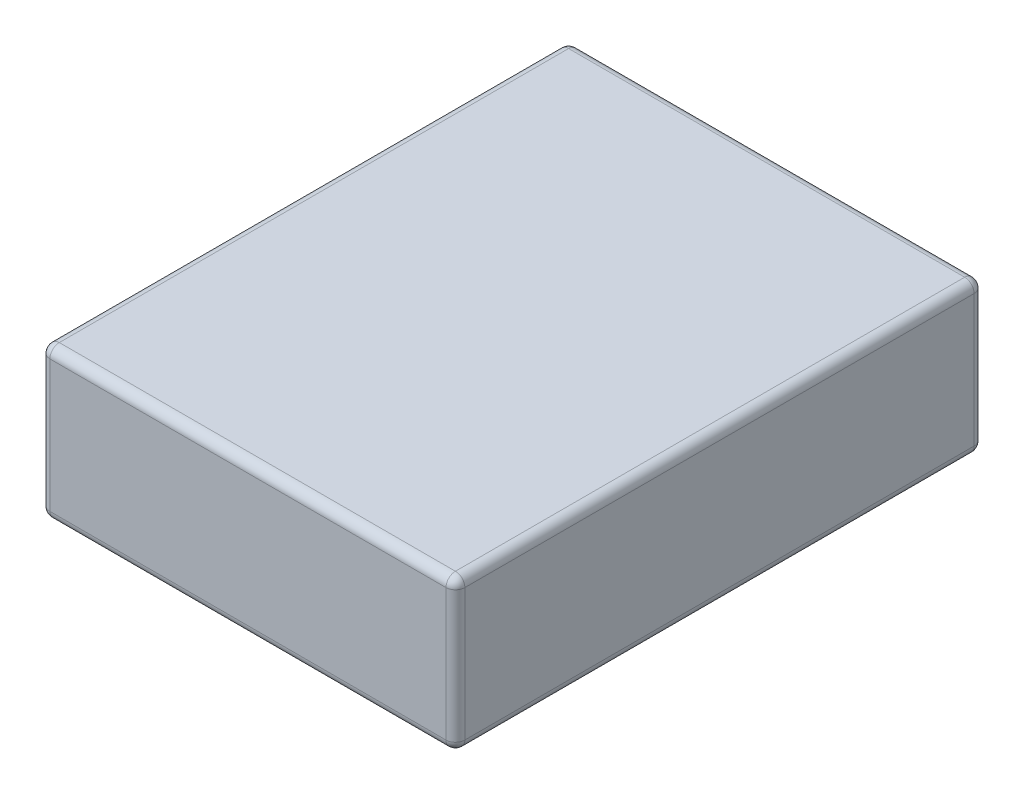
ISO-10303-21;
HEADER;
FILE_DESCRIPTION(('STEP AP214'),'2;1');
FILE_NAME('part.step','',(''),(''),'','','');
FILE_SCHEMA(('AUTOMOTIVE_DESIGN { 1 0 10303 214 1 1 1 1 }'));
ENDSEC;
DATA;
#1=APPLICATION_CONTEXT('core data for automotive mechanical design processes');
#2=APPLICATION_PROTOCOL_DEFINITION('international standard','automotive_design',2000,#1);
#3=PRODUCT_CONTEXT('',#1,'mechanical');
#4=PRODUCT('Part','Part','',(#3));
#5=PRODUCT_RELATED_PRODUCT_CATEGORY('part','',(#4));
#6=PRODUCT_DEFINITION_FORMATION('','',#4);
#7=PRODUCT_DEFINITION_CONTEXT('part definition',#1,'design');
#8=PRODUCT_DEFINITION('design','',#6,#7);
#9=PRODUCT_DEFINITION_SHAPE('','',#8);
#10=(LENGTH_UNIT() NAMED_UNIT(*) SI_UNIT(.MILLI.,.METRE.));
#11=(NAMED_UNIT(*) PLANE_ANGLE_UNIT() SI_UNIT($,.RADIAN.));
#12=(NAMED_UNIT(*) SI_UNIT($,.STERADIAN.) SOLID_ANGLE_UNIT());
#13=UNCERTAINTY_MEASURE_WITH_UNIT(LENGTH_MEASURE(1.E-05),#10,'distance_accuracy_value','');
#14=(GEOMETRIC_REPRESENTATION_CONTEXT(3) GLOBAL_UNCERTAINTY_ASSIGNED_CONTEXT((#13)) GLOBAL_UNIT_ASSIGNED_CONTEXT((#10,
#11,#12)) REPRESENTATION_CONTEXT('',''));
#15=CARTESIAN_POINT('',(0.,0.,0.));
#16=DIRECTION('',(0.,0.,1.));
#17=DIRECTION('',(1.,0.,0.));
#18=AXIS2_PLACEMENT_3D('',#15,#16,#17);
#19=CARTESIAN_POINT('',(-11.,8.,-14.));
#20=DIRECTION('',(1.,0.,0.));
#21=DIRECTION('',(0.,0.,-1.));
#22=AXIS2_PLACEMENT_3D('',#19,#20,#21);
#23=PLANE('',#22);
#24=DIRECTION('',(0.,-1.,0.));
#25=VECTOR('',#24,1.);
#26=CARTESIAN_POINT('',(-11.,8.,-13.5));
#27=LINE('',#26,#25);
#28=CARTESIAN_POINT('',(-11.,7.5,-13.5));
#29=VERTEX_POINT('',#28);
#30=CARTESIAN_POINT('',(-11.,0.5,-13.5));
#31=VERTEX_POINT('',#30);
#32=EDGE_CURVE('E138',#29,#31,#27,.T.);
#33=ORIENTED_EDGE('',*,*,#32,.T.);
#34=DIRECTION('',(0.,0.,1.));
#35=VECTOR('',#34,1.);
#36=CARTESIAN_POINT('',(-11.,0.5,14.));
#37=LINE('',#36,#35);
#38=CARTESIAN_POINT('',(-11.,0.5,13.5));
#39=VERTEX_POINT('',#38);
#40=EDGE_CURVE('E133',#31,#39,#37,.T.);
#41=ORIENTED_EDGE('',*,*,#40,.T.);
#42=DIRECTION('',(0.,-1.,0.));
#43=VECTOR('',#42,1.);
#44=CARTESIAN_POINT('',(-11.,8.,13.5));
#45=LINE('',#44,#43);
#46=CARTESIAN_POINT('',(-11.,7.5,13.5));
#47=VERTEX_POINT('',#46);
#48=EDGE_CURVE('E128',#39,#47,#45,.F.);
#49=ORIENTED_EDGE('',*,*,#48,.T.);
#50=DIRECTION('',(0.,0.,1.));
#51=VECTOR('',#50,1.);
#52=CARTESIAN_POINT('',(-11.,7.5,-14.));
#53=LINE('',#52,#51);
#54=EDGE_CURVE('E130',#47,#29,#53,.F.);
#55=ORIENTED_EDGE('',*,*,#54,.T.);
#56=EDGE_LOOP('',(#33,#41,#49,#55));
#57=FACE_BOUND('',#56,.T.);
#58=ADVANCED_FACE('F39',(#57),#23,.F.);
#59=CARTESIAN_POINT('',(11.,8.,14.));
#60=DIRECTION('',(0.,0.,-1.));
#61=DIRECTION('',(-1.,0.,0.));
#62=AXIS2_PLACEMENT_3D('',#59,#60,#61);
#63=PLANE('',#62);
#64=DIRECTION('',(0.,-1.,0.));
#65=VECTOR('',#64,1.);
#66=CARTESIAN_POINT('',(-10.5,8.,14.));
#67=LINE('',#66,#65);
#68=CARTESIAN_POINT('',(-10.5,7.5,14.));
#69=VERTEX_POINT('',#68);
#70=CARTESIAN_POINT('',(-10.5,0.5,14.));
#71=VERTEX_POINT('',#70);
#72=EDGE_CURVE('E162',#69,#71,#67,.T.);
#73=ORIENTED_EDGE('',*,*,#72,.T.);
#74=DIRECTION('',(1.,0.,0.));
#75=VECTOR('',#74,1.);
#76=CARTESIAN_POINT('',(11.,0.5,14.));
#77=LINE('',#76,#75);
#78=CARTESIAN_POINT('',(10.5,0.5,14.));
#79=VERTEX_POINT('',#78);
#80=EDGE_CURVE('E263',#71,#79,#77,.T.);
#81=ORIENTED_EDGE('',*,*,#80,.T.);
#82=DIRECTION('',(0.,-1.,0.));
#83=VECTOR('',#82,1.);
#84=CARTESIAN_POINT('',(10.5,8.,14.));
#85=LINE('',#84,#83);
#86=CARTESIAN_POINT('',(10.5,7.5,14.));
#87=VERTEX_POINT('',#86);
#88=EDGE_CURVE('E254',#79,#87,#85,.F.);
#89=ORIENTED_EDGE('',*,*,#88,.T.);
#90=DIRECTION('',(1.,0.,0.));
#91=VECTOR('',#90,1.);
#92=CARTESIAN_POINT('',(11.,7.5,14.));
#93=LINE('',#92,#91);
#94=EDGE_CURVE('E250',#87,#69,#93,.F.);
#95=ORIENTED_EDGE('',*,*,#94,.T.);
#96=EDGE_LOOP('',(#73,#81,#89,#95));
#97=FACE_BOUND('',#96,.T.);
#98=ADVANCED_FACE('F374',(#97),#63,.F.);
#99=CARTESIAN_POINT('',(11.,8.,-14.));
#100=DIRECTION('',(-1.,0.,0.));
#101=DIRECTION('',(0.,0.,1.));
#102=AXIS2_PLACEMENT_3D('',#99,#100,#101);
#103=PLANE('',#102);
#104=DIRECTION('',(0.,0.,-1.));
#105=VECTOR('',#104,1.);
#106=CARTESIAN_POINT('',(11.,0.5,-14.));
#107=LINE('',#106,#105);
#108=CARTESIAN_POINT('',(11.,0.5,13.5));
#109=VERTEX_POINT('',#108);
#110=CARTESIAN_POINT('',(11.,0.5,-13.5));
#111=VERTEX_POINT('',#110);
#112=EDGE_CURVE('E245',#109,#111,#107,.T.);
#113=ORIENTED_EDGE('',*,*,#112,.T.);
#114=DIRECTION('',(0.,-1.,0.));
#115=VECTOR('',#114,1.);
#116=CARTESIAN_POINT('',(11.,8.,-13.5));
#117=LINE('',#116,#115);
#118=CARTESIAN_POINT('',(11.,7.5,-13.5));
#119=VERTEX_POINT('',#118);
#120=EDGE_CURVE('E242',#111,#119,#117,.F.);
#121=ORIENTED_EDGE('',*,*,#120,.T.);
#122=DIRECTION('',(0.,0.,-1.));
#123=VECTOR('',#122,1.);
#124=CARTESIAN_POINT('',(11.,7.5,-14.));
#125=LINE('',#124,#123);
#126=CARTESIAN_POINT('',(11.,7.5,13.5));
#127=VERTEX_POINT('',#126);
#128=EDGE_CURVE('E234',#119,#127,#125,.F.);
#129=ORIENTED_EDGE('',*,*,#128,.T.);
#130=DIRECTION('',(0.,-1.,0.));
#131=VECTOR('',#130,1.);
#132=CARTESIAN_POINT('',(11.,8.,13.5));
#133=LINE('',#132,#131);
#134=EDGE_CURVE('E238',#127,#109,#133,.T.);
#135=ORIENTED_EDGE('',*,*,#134,.T.);
#136=EDGE_LOOP('',(#113,#121,#129,#135));
#137=FACE_BOUND('',#136,.T.);
#138=ADVANCED_FACE('F243',(#137),#103,.F.);
#139=CARTESIAN_POINT('',(11.,8.,-14.));
#140=DIRECTION('',(0.,0.,1.));
#141=DIRECTION('',(1.,0.,0.));
#142=AXIS2_PLACEMENT_3D('',#139,#140,#141);
#143=PLANE('',#142);
#144=DIRECTION('',(-1.,0.,0.));
#145=VECTOR('',#144,1.);
#146=CARTESIAN_POINT('',(-11.,0.5,-14.));
#147=LINE('',#146,#145);
#148=CARTESIAN_POINT('',(10.5,0.5,-14.));
#149=VERTEX_POINT('',#148);
#150=CARTESIAN_POINT('',(-10.5,0.5,-14.));
#151=VERTEX_POINT('',#150);
#152=EDGE_CURVE('E326',#149,#151,#147,.T.);
#153=ORIENTED_EDGE('',*,*,#152,.T.);
#154=DIRECTION('',(0.,-1.,0.));
#155=VECTOR('',#154,1.);
#156=CARTESIAN_POINT('',(-10.5,8.,-14.));
#157=LINE('',#156,#155);
#158=CARTESIAN_POINT('',(-10.5,7.5,-14.));
#159=VERTEX_POINT('',#158);
#160=EDGE_CURVE('E239',#151,#159,#157,.F.);
#161=ORIENTED_EDGE('',*,*,#160,.T.);
#162=DIRECTION('',(-1.,0.,0.));
#163=VECTOR('',#162,1.);
#164=CARTESIAN_POINT('',(11.,7.5,-14.));
#165=LINE('',#164,#163);
#166=CARTESIAN_POINT('',(10.5,7.5,-14.));
#167=VERTEX_POINT('',#166);
#168=EDGE_CURVE('E317',#159,#167,#165,.F.);
#169=ORIENTED_EDGE('',*,*,#168,.T.);
#170=DIRECTION('',(0.,-1.,0.));
#171=VECTOR('',#170,1.);
#172=CARTESIAN_POINT('',(10.5,8.,-14.));
#173=LINE('',#172,#171);
#174=EDGE_CURVE('E320',#167,#149,#173,.T.);
#175=ORIENTED_EDGE('',*,*,#174,.T.);
#176=EDGE_LOOP('',(#153,#161,#169,#175));
#177=FACE_BOUND('',#176,.T.);
#178=ADVANCED_FACE('F358',(#177),#143,.F.);
#179=CARTESIAN_POINT('',(0.,8.,0.));
#180=DIRECTION('',(0.,-1.,0.));
#181=DIRECTION('',(0.,0.,-1.));
#182=AXIS2_PLACEMENT_3D('',#179,#180,#181);
#183=PLANE('',#182);
#184=DIRECTION('',(0.,0.,-1.));
#185=VECTOR('',#184,1.);
#186=CARTESIAN_POINT('',(10.5,8.,0.));
#187=LINE('',#186,#185);
#188=CARTESIAN_POINT('',(10.5,8.,13.5));
#189=VERTEX_POINT('',#188);
#190=CARTESIAN_POINT('',(10.5,8.,-13.5));
#191=VERTEX_POINT('',#190);
#192=EDGE_CURVE('E49',#189,#191,#187,.T.);
#193=ORIENTED_EDGE('',*,*,#192,.T.);
#194=DIRECTION('',(-1.,0.,0.));
#195=VECTOR('',#194,1.);
#196=CARTESIAN_POINT('',(0.,8.,-13.5));
#197=LINE('',#196,#195);
#198=CARTESIAN_POINT('',(-10.5,8.,-13.5));
#199=VERTEX_POINT('',#198);
#200=EDGE_CURVE('E11',#191,#199,#197,.T.);
#201=ORIENTED_EDGE('',*,*,#200,.T.);
#202=DIRECTION('',(0.,0.,1.));
#203=VECTOR('',#202,1.);
#204=CARTESIAN_POINT('',(-10.5,8.,0.));
#205=LINE('',#204,#203);
#206=CARTESIAN_POINT('',(-10.5,8.,13.5));
#207=VERTEX_POINT('',#206);
#208=EDGE_CURVE('E266',#199,#207,#205,.T.);
#209=ORIENTED_EDGE('',*,*,#208,.T.);
#210=DIRECTION('',(1.,0.,0.));
#211=VECTOR('',#210,1.);
#212=CARTESIAN_POINT('',(0.,8.,13.5));
#213=LINE('',#212,#211);
#214=EDGE_CURVE('E60',#207,#189,#213,.T.);
#215=ORIENTED_EDGE('',*,*,#214,.T.);
#216=EDGE_LOOP('',(#193,#201,#209,#215));
#217=FACE_BOUND('',#216,.T.);
#218=ADVANCED_FACE('F537',(#217),#183,.F.);
#219=CARTESIAN_POINT('',(0.,0.,0.));
#220=DIRECTION('',(0.,-1.,0.));
#221=DIRECTION('',(0.,0.,-1.));
#222=AXIS2_PLACEMENT_3D('',#219,#220,#221);
#223=PLANE('',#222);
#224=DIRECTION('',(1.,0.,0.));
#225=VECTOR('',#224,1.);
#226=CARTESIAN_POINT('',(-11.,0.,13.5));
#227=LINE('',#226,#225);
#228=CARTESIAN_POINT('',(10.5,0.,13.5));
#229=VERTEX_POINT('',#228);
#230=CARTESIAN_POINT('',(-10.5,0.,13.5));
#231=VERTEX_POINT('',#230);
#232=EDGE_CURVE('E312',#229,#231,#227,.F.);
#233=ORIENTED_EDGE('',*,*,#232,.T.);
#234=DIRECTION('',(0.,0.,1.));
#235=VECTOR('',#234,1.);
#236=CARTESIAN_POINT('',(-10.5,0.,-14.));
#237=LINE('',#236,#235);
#238=CARTESIAN_POINT('',(-10.5,0.,-13.5));
#239=VERTEX_POINT('',#238);
#240=EDGE_CURVE('E306',#231,#239,#237,.F.);
#241=ORIENTED_EDGE('',*,*,#240,.T.);
#242=DIRECTION('',(-1.,0.,0.));
#243=VECTOR('',#242,1.);
#244=CARTESIAN_POINT('',(11.,0.,-13.5));
#245=LINE('',#244,#243);
#246=CARTESIAN_POINT('',(10.5,0.,-13.5));
#247=VERTEX_POINT('',#246);
#248=EDGE_CURVE('E299',#239,#247,#245,.F.);
#249=ORIENTED_EDGE('',*,*,#248,.T.);
#250=DIRECTION('',(0.,0.,-1.));
#251=VECTOR('',#250,1.);
#252=CARTESIAN_POINT('',(10.5,0.,14.));
#253=LINE('',#252,#251);
#254=EDGE_CURVE('E307',#247,#229,#253,.F.);
#255=ORIENTED_EDGE('',*,*,#254,.T.);
#256=EDGE_LOOP('',(#233,#241,#249,#255));
#257=FACE_BOUND('',#256,.T.);
#258=ADVANCED_FACE('F310',(#257),#223,.T.);
#259=CARTESIAN_POINT('',(10.5,7.5,0.));
#260=DIRECTION('',(0.,0.,-1.));
#261=DIRECTION('',(-1.,0.,0.));
#262=AXIS2_PLACEMENT_3D('',#259,#260,#261);
#263=CYLINDRICAL_SURFACE('',#262,0.5);
#264=CARTESIAN_POINT('',(10.5,7.5,-13.5));
#265=DIRECTION('',(0.,0.,-1.));
#266=DIRECTION('',(-1.,0.,0.));
#267=AXIS2_PLACEMENT_3D('',#264,#265,#266);
#268=CIRCLE('',#267,0.5);
#269=EDGE_CURVE('E43',#191,#119,#268,.T.);
#270=ORIENTED_EDGE('',*,*,#269,.F.);
#271=ORIENTED_EDGE('',*,*,#192,.F.);
#272=CARTESIAN_POINT('',(10.5,7.5,13.5));
#273=DIRECTION('',(0.,0.,1.));
#274=DIRECTION('',(1.,0.,0.));
#275=AXIS2_PLACEMENT_3D('',#272,#273,#274);
#276=CIRCLE('',#275,0.5);
#277=EDGE_CURVE('E217',#127,#189,#276,.T.);
#278=ORIENTED_EDGE('',*,*,#277,.F.);
#279=ORIENTED_EDGE('',*,*,#128,.F.);
#280=EDGE_LOOP('',(#270,#271,#278,#279));
#281=FACE_BOUND('',#280,.T.);
#282=ADVANCED_FACE('F41',(#281),#263,.T.);
#283=CARTESIAN_POINT('',(10.5,7.5,-13.5));
#284=DIRECTION('',(0.,0.,1.));
#285=DIRECTION('',(1.,0.,0.));
#286=AXIS2_PLACEMENT_3D('',#283,#284,#285);
#287=SPHERICAL_SURFACE('',#286,0.5);
#288=CARTESIAN_POINT('',(10.5,7.5,-13.5));
#289=DIRECTION('',(1.,0.,0.));
#290=DIRECTION('',(0.,0.,-1.));
#291=AXIS2_PLACEMENT_3D('',#288,#289,#290);
#292=CIRCLE('',#291,0.5);
#293=EDGE_CURVE('E211',#191,#167,#292,.F.);
#294=ORIENTED_EDGE('',*,*,#293,.F.);
#295=ORIENTED_EDGE('',*,*,#269,.T.);
#296=CARTESIAN_POINT('',(10.5,7.5,-13.5));
#297=DIRECTION('',(0.,1.,0.));
#298=DIRECTION('',(0.,0.,1.));
#299=AXIS2_PLACEMENT_3D('',#296,#297,#298);
#300=CIRCLE('',#299,0.5);
#301=EDGE_CURVE('E215',#167,#119,#300,.F.);
#302=ORIENTED_EDGE('',*,*,#301,.F.);
#303=EDGE_LOOP('',(#294,#295,#302));
#304=FACE_BOUND('',#303,.T.);
#305=ADVANCED_FACE('F230',(#304),#287,.T.);
#306=CARTESIAN_POINT('',(10.5,7.5,13.5));
#307=DIRECTION('',(0.,0.,1.));
#308=DIRECTION('',(1.,0.,0.));
#309=AXIS2_PLACEMENT_3D('',#306,#307,#308);
#310=SPHERICAL_SURFACE('',#309,0.5);
#311=CARTESIAN_POINT('',(10.5,7.5,13.5));
#312=DIRECTION('',(0.,1.,0.));
#313=DIRECTION('',(0.,0.,1.));
#314=AXIS2_PLACEMENT_3D('',#311,#312,#313);
#315=CIRCLE('',#314,0.5);
#316=EDGE_CURVE('E203',#127,#87,#315,.F.);
#317=ORIENTED_EDGE('',*,*,#316,.F.);
#318=ORIENTED_EDGE('',*,*,#277,.T.);
#319=CARTESIAN_POINT('',(10.5,7.5,13.5));
#320=DIRECTION('',(1.,0.,0.));
#321=DIRECTION('',(0.,0.,-1.));
#322=AXIS2_PLACEMENT_3D('',#319,#320,#321);
#323=CIRCLE('',#322,0.5);
#324=EDGE_CURVE('E207',#87,#189,#323,.F.);
#325=ORIENTED_EDGE('',*,*,#324,.F.);
#326=EDGE_LOOP('',(#317,#318,#325));
#327=FACE_BOUND('',#326,.T.);
#328=ADVANCED_FACE('F510',(#327),#310,.T.);
#329=CARTESIAN_POINT('',(10.5,8.,-13.5));
#330=DIRECTION('',(0.,-1.,0.));
#331=DIRECTION('',(0.,0.,-1.));
#332=AXIS2_PLACEMENT_3D('',#329,#330,#331);
#333=CYLINDRICAL_SURFACE('',#332,0.5);
#334=ORIENTED_EDGE('',*,*,#301,.T.);
#335=ORIENTED_EDGE('',*,*,#120,.F.);
#336=CARTESIAN_POINT('',(10.5,0.5,-13.5));
#337=DIRECTION('',(0.,-1.,0.));
#338=DIRECTION('',(0.,0.,-1.));
#339=AXIS2_PLACEMENT_3D('',#336,#337,#338);
#340=CIRCLE('',#339,0.5);
#341=EDGE_CURVE('E195',#149,#111,#340,.T.);
#342=ORIENTED_EDGE('',*,*,#341,.F.);
#343=ORIENTED_EDGE('',*,*,#174,.F.);
#344=EDGE_LOOP('',(#334,#335,#342,#343));
#345=FACE_BOUND('',#344,.T.);
#346=ADVANCED_FACE('F360',(#345),#333,.T.);
#347=CARTESIAN_POINT('',(0.,7.5,-13.5));
#348=DIRECTION('',(-1.,0.,0.));
#349=DIRECTION('',(0.,0.,1.));
#350=AXIS2_PLACEMENT_3D('',#347,#348,#349);
#351=CYLINDRICAL_SURFACE('',#350,0.5);
#352=ORIENTED_EDGE('',*,*,#293,.T.);
#353=ORIENTED_EDGE('',*,*,#168,.F.);
#354=CARTESIAN_POINT('',(-10.5,7.5,-13.5));
#355=DIRECTION('',(-1.,0.,0.));
#356=DIRECTION('',(0.,0.,1.));
#357=AXIS2_PLACEMENT_3D('',#354,#355,#356);
#358=CIRCLE('',#357,0.5);
#359=EDGE_CURVE('E191',#199,#159,#358,.T.);
#360=ORIENTED_EDGE('',*,*,#359,.F.);
#361=ORIENTED_EDGE('',*,*,#200,.F.);
#362=EDGE_LOOP('',(#352,#353,#360,#361));
#363=FACE_BOUND('',#362,.T.);
#364=ADVANCED_FACE('F494',(#363),#351,.T.);
#365=CARTESIAN_POINT('',(-10.5,7.5,0.));
#366=DIRECTION('',(0.,0.,1.));
#367=DIRECTION('',(1.,0.,0.));
#368=AXIS2_PLACEMENT_3D('',#365,#366,#367);
#369=CYLINDRICAL_SURFACE('',#368,0.5);
#370=CARTESIAN_POINT('',(-10.5,7.5,13.5));
#371=DIRECTION('',(0.,0.,1.));
#372=DIRECTION('',(1.,0.,0.));
#373=AXIS2_PLACEMENT_3D('',#370,#371,#372);
#374=CIRCLE('',#373,0.5);
#375=EDGE_CURVE('E145',#207,#47,#374,.T.);
#376=ORIENTED_EDGE('',*,*,#375,.F.);
#377=ORIENTED_EDGE('',*,*,#208,.F.);
#378=CARTESIAN_POINT('',(-10.5,7.5,-13.5));
#379=DIRECTION('',(0.,0.,-1.));
#380=DIRECTION('',(-1.,0.,0.));
#381=AXIS2_PLACEMENT_3D('',#378,#379,#380);
#382=CIRCLE('',#381,0.5);
#383=EDGE_CURVE('E147',#29,#199,#382,.T.);
#384=ORIENTED_EDGE('',*,*,#383,.F.);
#385=ORIENTED_EDGE('',*,*,#54,.F.);
#386=EDGE_LOOP('',(#376,#377,#384,#385));
#387=FACE_BOUND('',#386,.T.);
#388=ADVANCED_FACE('F143',(#387),#369,.T.);
#389=CARTESIAN_POINT('',(0.,7.5,13.5));
#390=DIRECTION('',(1.,0.,0.));
#391=DIRECTION('',(0.,0.,-1.));
#392=AXIS2_PLACEMENT_3D('',#389,#390,#391);
#393=CYLINDRICAL_SURFACE('',#392,0.5);
#394=ORIENTED_EDGE('',*,*,#324,.T.);
#395=ORIENTED_EDGE('',*,*,#214,.F.);
#396=CARTESIAN_POINT('',(-10.5,7.5,13.5));
#397=DIRECTION('',(-1.,0.,0.));
#398=DIRECTION('',(0.,0.,1.));
#399=AXIS2_PLACEMENT_3D('',#396,#397,#398);
#400=CIRCLE('',#399,0.5);
#401=EDGE_CURVE('E157',#69,#207,#400,.T.);
#402=ORIENTED_EDGE('',*,*,#401,.F.);
#403=ORIENTED_EDGE('',*,*,#94,.F.);
#404=EDGE_LOOP('',(#394,#395,#402,#403));
#405=FACE_BOUND('',#404,.T.);
#406=ADVANCED_FACE('F478',(#405),#393,.T.);
#407=CARTESIAN_POINT('',(10.5,8.,13.5));
#408=DIRECTION('',(0.,-1.,0.));
#409=DIRECTION('',(0.,0.,-1.));
#410=AXIS2_PLACEMENT_3D('',#407,#408,#409);
#411=CYLINDRICAL_SURFACE('',#410,0.5);
#412=ORIENTED_EDGE('',*,*,#316,.T.);
#413=ORIENTED_EDGE('',*,*,#88,.F.);
#414=CARTESIAN_POINT('',(10.5,0.5,13.5));
#415=DIRECTION('',(0.,-1.,0.));
#416=DIRECTION('',(0.,0.,-1.));
#417=AXIS2_PLACEMENT_3D('',#414,#415,#416);
#418=CIRCLE('',#417,0.5);
#419=EDGE_CURVE('E183',#109,#79,#418,.T.);
#420=ORIENTED_EDGE('',*,*,#419,.F.);
#421=ORIENTED_EDGE('',*,*,#134,.F.);
#422=EDGE_LOOP('',(#412,#413,#420,#421));
#423=FACE_BOUND('',#422,.T.);
#424=ADVANCED_FACE('F340',(#423),#411,.T.);
#425=CARTESIAN_POINT('',(10.5,0.5,-14.));
#426=DIRECTION('',(0.,0.,1.));
#427=DIRECTION('',(1.,0.,0.));
#428=AXIS2_PLACEMENT_3D('',#425,#426,#427);
#429=CYLINDRICAL_SURFACE('',#428,0.5);
#430=CARTESIAN_POINT('',(10.5,0.5,-13.5));
#431=DIRECTION('',(0.,0.,-1.));
#432=DIRECTION('',(-1.,0.,0.));
#433=AXIS2_PLACEMENT_3D('',#430,#431,#432);
#434=CIRCLE('',#433,0.5);
#435=EDGE_CURVE('E199',#111,#247,#434,.T.);
#436=ORIENTED_EDGE('',*,*,#435,.F.);
#437=ORIENTED_EDGE('',*,*,#112,.F.);
#438=CARTESIAN_POINT('',(10.5,0.5,13.5));
#439=DIRECTION('',(0.,0.,1.));
#440=DIRECTION('',(1.,0.,0.));
#441=AXIS2_PLACEMENT_3D('',#438,#439,#440);
#442=CIRCLE('',#441,0.5);
#443=EDGE_CURVE('E179',#229,#109,#442,.T.);
#444=ORIENTED_EDGE('',*,*,#443,.F.);
#445=ORIENTED_EDGE('',*,*,#254,.F.);
#446=EDGE_LOOP('',(#436,#437,#444,#445));
#447=FACE_BOUND('',#446,.T.);
#448=ADVANCED_FACE('F337',(#447),#429,.T.);
#449=CARTESIAN_POINT('',(10.5,0.5,-13.5));
#450=DIRECTION('',(0.,0.,1.));
#451=DIRECTION('',(1.,0.,0.));
#452=AXIS2_PLACEMENT_3D('',#449,#450,#451);
#453=SPHERICAL_SURFACE('',#452,0.5);
#454=ORIENTED_EDGE('',*,*,#341,.T.);
#455=ORIENTED_EDGE('',*,*,#435,.T.);
#456=CARTESIAN_POINT('',(10.5,0.5,-13.5));
#457=DIRECTION('',(1.,0.,0.));
#458=DIRECTION('',(0.,0.,-1.));
#459=AXIS2_PLACEMENT_3D('',#456,#457,#458);
#460=CIRCLE('',#459,0.5);
#461=EDGE_CURVE('E169',#149,#247,#460,.F.);
#462=ORIENTED_EDGE('',*,*,#461,.F.);
#463=EDGE_LOOP('',(#454,#455,#462));
#464=FACE_BOUND('',#463,.T.);
#465=ADVANCED_FACE('F362',(#464),#453,.T.);
#466=CARTESIAN_POINT('',(-10.5,7.5,-13.5));
#467=DIRECTION('',(0.,0.,1.));
#468=DIRECTION('',(1.,0.,0.));
#469=AXIS2_PLACEMENT_3D('',#466,#467,#468);
#470=SPHERICAL_SURFACE('',#469,0.5);
#471=ORIENTED_EDGE('',*,*,#383,.T.);
#472=ORIENTED_EDGE('',*,*,#359,.T.);
#473=CARTESIAN_POINT('',(-10.5,7.5,-13.5));
#474=DIRECTION('',(0.,1.,0.));
#475=DIRECTION('',(0.,0.,1.));
#476=AXIS2_PLACEMENT_3D('',#473,#474,#475);
#477=CIRCLE('',#476,0.5);
#478=EDGE_CURVE('E164',#29,#159,#477,.F.);
#479=ORIENTED_EDGE('',*,*,#478,.F.);
#480=EDGE_LOOP('',(#471,#472,#479));
#481=FACE_BOUND('',#480,.T.);
#482=ADVANCED_FACE('F364',(#481),#470,.T.);
#483=CARTESIAN_POINT('',(-10.5,7.5,13.5));
#484=DIRECTION('',(0.,0.,1.));
#485=DIRECTION('',(1.,0.,0.));
#486=AXIS2_PLACEMENT_3D('',#483,#484,#485);
#487=SPHERICAL_SURFACE('',#486,0.5);
#488=ORIENTED_EDGE('',*,*,#401,.T.);
#489=ORIENTED_EDGE('',*,*,#375,.T.);
#490=CARTESIAN_POINT('',(-10.5,7.5,13.5));
#491=DIRECTION('',(0.,1.,0.));
#492=DIRECTION('',(0.,0.,1.));
#493=AXIS2_PLACEMENT_3D('',#490,#491,#492);
#494=CIRCLE('',#493,0.5);
#495=EDGE_CURVE('E154',#69,#47,#494,.F.);
#496=ORIENTED_EDGE('',*,*,#495,.F.);
#497=EDGE_LOOP('',(#488,#489,#496));
#498=FACE_BOUND('',#497,.T.);
#499=ADVANCED_FACE('F153',(#498),#487,.T.);
#500=CARTESIAN_POINT('',(10.5,0.5,13.5));
#501=DIRECTION('',(0.,0.,1.));
#502=DIRECTION('',(1.,0.,0.));
#503=AXIS2_PLACEMENT_3D('',#500,#501,#502);
#504=SPHERICAL_SURFACE('',#503,0.5);
#505=ORIENTED_EDGE('',*,*,#443,.T.);
#506=ORIENTED_EDGE('',*,*,#419,.T.);
#507=CARTESIAN_POINT('',(10.5,0.5,13.5));
#508=DIRECTION('',(1.,0.,0.));
#509=DIRECTION('',(0.,0.,-1.));
#510=AXIS2_PLACEMENT_3D('',#507,#508,#509);
#511=CIRCLE('',#510,0.5);
#512=EDGE_CURVE('E165',#229,#79,#511,.F.);
#513=ORIENTED_EDGE('',*,*,#512,.F.);
#514=EDGE_LOOP('',(#505,#506,#513));
#515=FACE_BOUND('',#514,.T.);
#516=ADVANCED_FACE('F342',(#515),#504,.T.);
#517=CARTESIAN_POINT('',(11.,0.5,-13.5));
#518=DIRECTION('',(1.,0.,0.));
#519=DIRECTION('',(0.,0.,-1.));
#520=AXIS2_PLACEMENT_3D('',#517,#518,#519);
#521=CYLINDRICAL_SURFACE('',#520,0.5);
#522=ORIENTED_EDGE('',*,*,#461,.T.);
#523=ORIENTED_EDGE('',*,*,#248,.F.);
#524=CARTESIAN_POINT('',(-10.5,0.5,-13.5));
#525=DIRECTION('',(-1.,0.,0.));
#526=DIRECTION('',(0.,0.,1.));
#527=AXIS2_PLACEMENT_3D('',#524,#525,#526);
#528=CIRCLE('',#527,0.5);
#529=EDGE_CURVE('E172',#151,#239,#528,.T.);
#530=ORIENTED_EDGE('',*,*,#529,.F.);
#531=ORIENTED_EDGE('',*,*,#152,.F.);
#532=EDGE_LOOP('',(#522,#523,#530,#531));
#533=FACE_BOUND('',#532,.T.);
#534=ADVANCED_FACE('F301',(#533),#521,.T.);
#535=CARTESIAN_POINT('',(-10.5,8.,-13.5));
#536=DIRECTION('',(0.,-1.,0.));
#537=DIRECTION('',(0.,0.,-1.));
#538=AXIS2_PLACEMENT_3D('',#535,#536,#537);
#539=CYLINDRICAL_SURFACE('',#538,0.5);
#540=ORIENTED_EDGE('',*,*,#478,.T.);
#541=ORIENTED_EDGE('',*,*,#160,.F.);
#542=CARTESIAN_POINT('',(-10.5,0.5,-13.5));
#543=DIRECTION('',(0.,-1.,0.));
#544=DIRECTION('',(0.,0.,-1.));
#545=AXIS2_PLACEMENT_3D('',#542,#543,#544);
#546=CIRCLE('',#545,0.5);
#547=EDGE_CURVE('E286',#31,#151,#546,.T.);
#548=ORIENTED_EDGE('',*,*,#547,.F.);
#549=ORIENTED_EDGE('',*,*,#32,.F.);
#550=EDGE_LOOP('',(#540,#541,#548,#549));
#551=FACE_BOUND('',#550,.T.);
#552=ADVANCED_FACE('F356',(#551),#539,.T.);
#553=CARTESIAN_POINT('',(-10.5,8.,13.5));
#554=DIRECTION('',(0.,-1.,0.));
#555=DIRECTION('',(0.,0.,-1.));
#556=AXIS2_PLACEMENT_3D('',#553,#554,#555);
#557=CYLINDRICAL_SURFACE('',#556,0.5);
#558=ORIENTED_EDGE('',*,*,#495,.T.);
#559=ORIENTED_EDGE('',*,*,#48,.F.);
#560=CARTESIAN_POINT('',(-10.5,0.5,13.5));
#561=DIRECTION('',(0.,-1.,0.));
#562=DIRECTION('',(0.,0.,-1.));
#563=AXIS2_PLACEMENT_3D('',#560,#561,#562);
#564=CIRCLE('',#563,0.5);
#565=EDGE_CURVE('E282',#71,#39,#564,.T.);
#566=ORIENTED_EDGE('',*,*,#565,.F.);
#567=ORIENTED_EDGE('',*,*,#72,.F.);
#568=EDGE_LOOP('',(#558,#559,#566,#567));
#569=FACE_BOUND('',#568,.T.);
#570=ADVANCED_FACE('F160',(#569),#557,.T.);
#571=CARTESIAN_POINT('',(11.,0.5,13.5));
#572=DIRECTION('',(-1.,0.,0.));
#573=DIRECTION('',(0.,0.,1.));
#574=AXIS2_PLACEMENT_3D('',#571,#572,#573);
#575=CYLINDRICAL_SURFACE('',#574,0.5);
#576=ORIENTED_EDGE('',*,*,#512,.T.);
#577=ORIENTED_EDGE('',*,*,#80,.F.);
#578=CARTESIAN_POINT('',(-10.5,0.5,13.5));
#579=DIRECTION('',(-1.,0.,0.));
#580=DIRECTION('',(0.,0.,1.));
#581=AXIS2_PLACEMENT_3D('',#578,#579,#580);
#582=CIRCLE('',#581,0.5);
#583=EDGE_CURVE('E279',#231,#71,#582,.T.);
#584=ORIENTED_EDGE('',*,*,#583,.F.);
#585=ORIENTED_EDGE('',*,*,#232,.F.);
#586=EDGE_LOOP('',(#576,#577,#584,#585));
#587=FACE_BOUND('',#586,.T.);
#588=ADVANCED_FACE('F345',(#587),#575,.T.);
#589=CARTESIAN_POINT('',(-10.5,0.5,-13.5));
#590=DIRECTION('',(0.,0.,1.));
#591=DIRECTION('',(1.,0.,0.));
#592=AXIS2_PLACEMENT_3D('',#589,#590,#591);
#593=SPHERICAL_SURFACE('',#592,0.5);
#594=ORIENTED_EDGE('',*,*,#547,.T.);
#595=ORIENTED_EDGE('',*,*,#529,.T.);
#596=CARTESIAN_POINT('',(-10.5,0.5,-13.5));
#597=DIRECTION('',(0.,0.,-1.));
#598=DIRECTION('',(-1.,0.,0.));
#599=AXIS2_PLACEMENT_3D('',#596,#597,#598);
#600=CIRCLE('',#599,0.5);
#601=EDGE_CURVE('E276',#31,#239,#600,.F.);
#602=ORIENTED_EDGE('',*,*,#601,.F.);
#603=EDGE_LOOP('',(#594,#595,#602));
#604=FACE_BOUND('',#603,.T.);
#605=ADVANCED_FACE('F295',(#604),#593,.T.);
#606=CARTESIAN_POINT('',(-10.5,0.5,13.5));
#607=DIRECTION('',(0.,0.,1.));
#608=DIRECTION('',(1.,0.,0.));
#609=AXIS2_PLACEMENT_3D('',#606,#607,#608);
#610=SPHERICAL_SURFACE('',#609,0.5);
#611=ORIENTED_EDGE('',*,*,#583,.T.);
#612=ORIENTED_EDGE('',*,*,#565,.T.);
#613=CARTESIAN_POINT('',(-10.5,0.5,13.5));
#614=DIRECTION('',(0.,0.,1.));
#615=DIRECTION('',(1.,0.,0.));
#616=AXIS2_PLACEMENT_3D('',#613,#614,#615);
#617=CIRCLE('',#616,0.5);
#618=EDGE_CURVE('E273',#231,#39,#617,.F.);
#619=ORIENTED_EDGE('',*,*,#618,.F.);
#620=EDGE_LOOP('',(#611,#612,#619));
#621=FACE_BOUND('',#620,.T.);
#622=ADVANCED_FACE('F386',(#621),#610,.T.);
#623=CARTESIAN_POINT('',(-10.5,0.5,-14.));
#624=DIRECTION('',(0.,0.,-1.));
#625=DIRECTION('',(-1.,0.,0.));
#626=AXIS2_PLACEMENT_3D('',#623,#624,#625);
#627=CYLINDRICAL_SURFACE('',#626,0.5);
#628=ORIENTED_EDGE('',*,*,#601,.T.);
#629=ORIENTED_EDGE('',*,*,#240,.F.);
#630=ORIENTED_EDGE('',*,*,#618,.T.);
#631=ORIENTED_EDGE('',*,*,#40,.F.);
#632=EDGE_LOOP('',(#628,#629,#630,#631));
#633=FACE_BOUND('',#632,.T.);
#634=ADVANCED_FACE('F383',(#633),#627,.T.);
#635=CLOSED_SHELL('',(#58,#98,#138,#178,#218,#258,#282,#305,#328,#346,#364,#388,#406,#424,#448,
#465,#482,#499,#516,#534,#552,#570,#588,#605,#622,#634));
#636=MANIFOLD_SOLID_BREP('B2',#635);
#637=ADVANCED_BREP_SHAPE_REPRESENTATION('',(#18,#636),#14);
#638=SHAPE_DEFINITION_REPRESENTATION(#9,#637);
ENDSEC;
END-ISO-10303-21;
